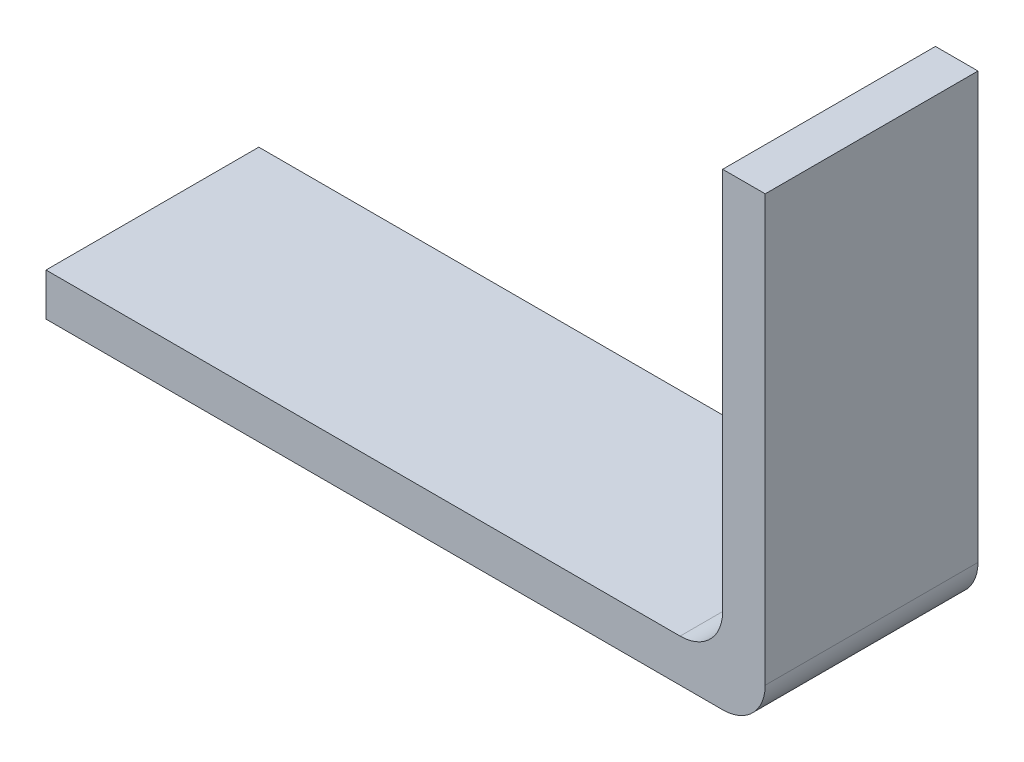
ISO-10303-21;
HEADER;
FILE_DESCRIPTION(('STEP AP214'),'2;1');
FILE_NAME('part.step','',(''),(''),'','','');
FILE_SCHEMA(('AUTOMOTIVE_DESIGN { 1 0 10303 214 1 1 1 1 }'));
ENDSEC;
DATA;
#1=APPLICATION_CONTEXT('core data for automotive mechanical design processes');
#2=APPLICATION_PROTOCOL_DEFINITION('international standard','automotive_design',2000,#1);
#3=PRODUCT_CONTEXT('',#1,'mechanical');
#4=PRODUCT('Part','Part','',(#3));
#5=PRODUCT_RELATED_PRODUCT_CATEGORY('part','',(#4));
#6=PRODUCT_DEFINITION_FORMATION('','',#4);
#7=PRODUCT_DEFINITION_CONTEXT('part definition',#1,'design');
#8=PRODUCT_DEFINITION('design','',#6,#7);
#9=PRODUCT_DEFINITION_SHAPE('','',#8);
#10=(LENGTH_UNIT() NAMED_UNIT(*) SI_UNIT(.MILLI.,.METRE.));
#11=(NAMED_UNIT(*) PLANE_ANGLE_UNIT() SI_UNIT($,.RADIAN.));
#12=(NAMED_UNIT(*) SI_UNIT($,.STERADIAN.) SOLID_ANGLE_UNIT());
#13=UNCERTAINTY_MEASURE_WITH_UNIT(LENGTH_MEASURE(1.E-05),#10,'distance_accuracy_value','');
#14=(GEOMETRIC_REPRESENTATION_CONTEXT(3) GLOBAL_UNCERTAINTY_ASSIGNED_CONTEXT((#13)) GLOBAL_UNIT_ASSIGNED_CONTEXT((#10,
#11,#12)) REPRESENTATION_CONTEXT('',''));
#15=CARTESIAN_POINT('',(0.,0.,0.));
#16=DIRECTION('',(0.,0.,1.));
#17=DIRECTION('',(1.,0.,0.));
#18=AXIS2_PLACEMENT_3D('',#15,#16,#17);
#19=CARTESIAN_POINT('',(16.9,0.,5.));
#20=DIRECTION('',(-1.,0.,0.));
#21=DIRECTION('',(0.,0.,1.));
#22=AXIS2_PLACEMENT_3D('',#19,#20,#21);
#23=PLANE('',#22);
#24=DIRECTION('',(0.,1.,0.));
#25=VECTOR('',#24,1.);
#26=CARTESIAN_POINT('',(16.9,0.,5.));
#27=LINE('',#26,#25);
#28=CARTESIAN_POINT('',(16.9,0.,5.));
#29=VERTEX_POINT('',#28);
#30=CARTESIAN_POINT('',(16.9,10.,5.));
#31=VERTEX_POINT('',#30);
#32=EDGE_CURVE('E97',#29,#31,#27,.T.);
#33=ORIENTED_EDGE('',*,*,#32,.F.);
#34=DIRECTION('',(0.,0.,-1.));
#35=VECTOR('',#34,1.);
#36=CARTESIAN_POINT('',(16.9,0.,5.));
#37=LINE('',#36,#35);
#38=CARTESIAN_POINT('',(16.9,0.,0.));
#39=VERTEX_POINT('',#38);
#40=EDGE_CURVE('E117',#29,#39,#37,.T.);
#41=ORIENTED_EDGE('',*,*,#40,.T.);
#42=DIRECTION('',(0.,1.,0.));
#43=VECTOR('',#42,1.);
#44=CARTESIAN_POINT('',(16.9,0.,0.));
#45=LINE('',#44,#43);
#46=CARTESIAN_POINT('',(16.9,10.,0.));
#47=VERTEX_POINT('',#46);
#48=EDGE_CURVE('E113',#39,#47,#45,.T.);
#49=ORIENTED_EDGE('',*,*,#48,.T.);
#50=DIRECTION('',(0.,0.,-1.));
#51=VECTOR('',#50,1.);
#52=CARTESIAN_POINT('',(16.9,10.,5.));
#53=LINE('',#52,#51);
#54=EDGE_CURVE('E111',#31,#47,#53,.T.);
#55=ORIENTED_EDGE('',*,*,#54,.F.);
#56=EDGE_LOOP('',(#33,#41,#49,#55));
#57=FACE_BOUND('',#56,.T.);
#58=ADVANCED_FACE('F33',(#57),#23,.F.);
#59=CARTESIAN_POINT('',(15.9,10.,5.));
#60=DIRECTION('',(0.,1.,0.));
#61=DIRECTION('',(0.,0.,1.));
#62=AXIS2_PLACEMENT_3D('',#59,#60,#61);
#63=PLANE('',#62);
#64=DIRECTION('',(1.,0.,0.));
#65=VECTOR('',#64,1.);
#66=CARTESIAN_POINT('',(15.9,10.,0.));
#67=LINE('',#66,#65);
#68=CARTESIAN_POINT('',(15.9,10.,0.));
#69=VERTEX_POINT('',#68);
#70=EDGE_CURVE('E136',#69,#47,#67,.T.);
#71=ORIENTED_EDGE('',*,*,#70,.F.);
#72=DIRECTION('',(0.,0.,-1.));
#73=VECTOR('',#72,1.);
#74=CARTESIAN_POINT('',(15.9,10.,5.));
#75=LINE('',#74,#73);
#76=CARTESIAN_POINT('',(15.9,10.,5.));
#77=VERTEX_POINT('',#76);
#78=EDGE_CURVE('E118',#77,#69,#75,.T.);
#79=ORIENTED_EDGE('',*,*,#78,.F.);
#80=DIRECTION('',(1.,0.,0.));
#81=VECTOR('',#80,1.);
#82=CARTESIAN_POINT('',(15.9,10.,5.));
#83=LINE('',#82,#81);
#84=EDGE_CURVE('E102',#77,#31,#83,.T.);
#85=ORIENTED_EDGE('',*,*,#84,.T.);
#86=ORIENTED_EDGE('',*,*,#54,.T.);
#87=EDGE_LOOP('',(#71,#79,#85,#86));
#88=FACE_BOUND('',#87,.T.);
#89=ADVANCED_FACE('F121',(#88),#63,.T.);
#90=CARTESIAN_POINT('',(15.9,0.,5.));
#91=DIRECTION('',(-1.,0.,0.));
#92=DIRECTION('',(0.,0.,1.));
#93=AXIS2_PLACEMENT_3D('',#90,#91,#92);
#94=PLANE('',#93);
#95=DIRECTION('',(0.,1.,0.));
#96=VECTOR('',#95,1.);
#97=CARTESIAN_POINT('',(15.9,0.,0.));
#98=LINE('',#97,#96);
#99=CARTESIAN_POINT('',(15.9,1.,0.));
#100=VERTEX_POINT('',#99);
#101=EDGE_CURVE('E138',#100,#69,#98,.T.);
#102=ORIENTED_EDGE('',*,*,#101,.F.);
#103=DIRECTION('',(0.,0.,-1.));
#104=VECTOR('',#103,1.);
#105=CARTESIAN_POINT('',(15.9,1.,5.));
#106=LINE('',#105,#104);
#107=CARTESIAN_POINT('',(15.9,1.,5.));
#108=VERTEX_POINT('',#107);
#109=EDGE_CURVE('E54',#100,#108,#106,.F.);
#110=ORIENTED_EDGE('',*,*,#109,.T.);
#111=DIRECTION('',(0.,1.,0.));
#112=VECTOR('',#111,1.);
#113=CARTESIAN_POINT('',(15.9,0.,5.));
#114=LINE('',#113,#112);
#115=EDGE_CURVE('E123',#108,#77,#114,.T.);
#116=ORIENTED_EDGE('',*,*,#115,.T.);
#117=ORIENTED_EDGE('',*,*,#78,.T.);
#118=EDGE_LOOP('',(#102,#110,#116,#117));
#119=FACE_BOUND('',#118,.T.);
#120=ADVANCED_FACE('F166',(#119),#94,.T.);
#121=CARTESIAN_POINT('',(0.,0.,5.));
#122=DIRECTION('',(0.,1.,0.));
#123=DIRECTION('',(0.,0.,1.));
#124=AXIS2_PLACEMENT_3D('',#121,#122,#123);
#125=PLANE('',#124);
#126=DIRECTION('',(1.,0.,0.));
#127=VECTOR('',#126,1.);
#128=CARTESIAN_POINT('',(0.,0.,5.));
#129=LINE('',#128,#127);
#130=CARTESIAN_POINT('',(0.,0.,5.));
#131=VERTEX_POINT('',#130);
#132=CARTESIAN_POINT('',(14.9,0.,5.));
#133=VERTEX_POINT('',#132);
#134=EDGE_CURVE('E125',#131,#133,#129,.T.);
#135=ORIENTED_EDGE('',*,*,#134,.T.);
#136=DIRECTION('',(0.,0.,-1.));
#137=VECTOR('',#136,1.);
#138=CARTESIAN_POINT('',(14.9,0.,0.));
#139=LINE('',#138,#137);
#140=CARTESIAN_POINT('',(14.9,0.,0.));
#141=VERTEX_POINT('',#140);
#142=EDGE_CURVE('E158',#133,#141,#139,.T.);
#143=ORIENTED_EDGE('',*,*,#142,.T.);
#144=DIRECTION('',(1.,0.,0.));
#145=VECTOR('',#144,1.);
#146=CARTESIAN_POINT('',(0.,0.,0.));
#147=LINE('',#146,#145);
#148=CARTESIAN_POINT('',(0.,0.,0.));
#149=VERTEX_POINT('',#148);
#150=EDGE_CURVE('E140',#149,#141,#147,.T.);
#151=ORIENTED_EDGE('',*,*,#150,.F.);
#152=DIRECTION('',(0.,0.,-1.));
#153=VECTOR('',#152,1.);
#154=CARTESIAN_POINT('',(0.,0.,5.));
#155=LINE('',#154,#153);
#156=EDGE_CURVE('E149',#131,#149,#155,.T.);
#157=ORIENTED_EDGE('',*,*,#156,.F.);
#158=EDGE_LOOP('',(#135,#143,#151,#157));
#159=FACE_BOUND('',#158,.T.);
#160=ADVANCED_FACE('F168',(#159),#125,.T.);
#161=CARTESIAN_POINT('',(0.,-1.,5.));
#162=DIRECTION('',(-1.,0.,0.));
#163=DIRECTION('',(0.,0.,1.));
#164=AXIS2_PLACEMENT_3D('',#161,#162,#163);
#165=PLANE('',#164);
#166=DIRECTION('',(0.,1.,0.));
#167=VECTOR('',#166,1.);
#168=CARTESIAN_POINT('',(0.,-1.,0.));
#169=LINE('',#168,#167);
#170=CARTESIAN_POINT('',(0.,-1.,0.));
#171=VERTEX_POINT('',#170);
#172=EDGE_CURVE('E143',#171,#149,#169,.T.);
#173=ORIENTED_EDGE('',*,*,#172,.F.);
#174=DIRECTION('',(0.,0.,-1.));
#175=VECTOR('',#174,1.);
#176=CARTESIAN_POINT('',(0.,-1.,5.));
#177=LINE('',#176,#175);
#178=CARTESIAN_POINT('',(0.,-1.,5.));
#179=VERTEX_POINT('',#178);
#180=EDGE_CURVE('E134',#179,#171,#177,.T.);
#181=ORIENTED_EDGE('',*,*,#180,.F.);
#182=DIRECTION('',(0.,1.,0.));
#183=VECTOR('',#182,1.);
#184=CARTESIAN_POINT('',(0.,-1.,5.));
#185=LINE('',#184,#183);
#186=EDGE_CURVE('E129',#179,#131,#185,.T.);
#187=ORIENTED_EDGE('',*,*,#186,.T.);
#188=ORIENTED_EDGE('',*,*,#156,.T.);
#189=EDGE_LOOP('',(#173,#181,#187,#188));
#190=FACE_BOUND('',#189,.T.);
#191=ADVANCED_FACE('F172',(#190),#165,.T.);
#192=CARTESIAN_POINT('',(0.,-1.,5.));
#193=DIRECTION('',(0.,1.,0.));
#194=DIRECTION('',(0.,0.,1.));
#195=AXIS2_PLACEMENT_3D('',#192,#193,#194);
#196=PLANE('',#195);
#197=DIRECTION('',(1.,0.,0.));
#198=VECTOR('',#197,1.);
#199=CARTESIAN_POINT('',(0.,-1.,0.));
#200=LINE('',#199,#198);
#201=CARTESIAN_POINT('',(15.9,-1.,0.));
#202=VERTEX_POINT('',#201);
#203=EDGE_CURVE('E108',#171,#202,#200,.T.);
#204=ORIENTED_EDGE('',*,*,#203,.T.);
#205=DIRECTION('',(0.,0.,-1.));
#206=VECTOR('',#205,1.);
#207=CARTESIAN_POINT('',(15.9,-1.,5.));
#208=LINE('',#207,#206);
#209=CARTESIAN_POINT('',(15.9,-1.,5.));
#210=VERTEX_POINT('',#209);
#211=EDGE_CURVE('E155',#202,#210,#208,.F.);
#212=ORIENTED_EDGE('',*,*,#211,.T.);
#213=DIRECTION('',(1.,0.,0.));
#214=VECTOR('',#213,1.);
#215=CARTESIAN_POINT('',(0.,-1.,5.));
#216=LINE('',#215,#214);
#217=EDGE_CURVE('E132',#179,#210,#216,.T.);
#218=ORIENTED_EDGE('',*,*,#217,.F.);
#219=ORIENTED_EDGE('',*,*,#180,.T.);
#220=EDGE_LOOP('',(#204,#212,#218,#219));
#221=FACE_BOUND('',#220,.T.);
#222=ADVANCED_FACE('F176',(#221),#196,.F.);
#223=CARTESIAN_POINT('',(0.,0.,5.));
#224=DIRECTION('',(0.,0.,-1.));
#225=DIRECTION('',(-1.,0.,0.));
#226=AXIS2_PLACEMENT_3D('',#223,#224,#225);
#227=PLANE('',#226);
#228=ORIENTED_EDGE('',*,*,#217,.T.);
#229=CARTESIAN_POINT('',(15.9,0.,5.));
#230=DIRECTION('',(0.,0.,-1.));
#231=DIRECTION('',(-1.,0.,0.));
#232=AXIS2_PLACEMENT_3D('',#229,#230,#231);
#233=CIRCLE('',#232,1.);
#234=EDGE_CURVE('E104',#210,#29,#233,.F.);
#235=ORIENTED_EDGE('',*,*,#234,.T.);
#236=ORIENTED_EDGE('',*,*,#32,.T.);
#237=ORIENTED_EDGE('',*,*,#84,.F.);
#238=ORIENTED_EDGE('',*,*,#115,.F.);
#239=CARTESIAN_POINT('',(14.9,1.,5.));
#240=DIRECTION('',(0.,0.,-1.));
#241=DIRECTION('',(-1.,0.,0.));
#242=AXIS2_PLACEMENT_3D('',#239,#240,#241);
#243=CIRCLE('',#242,1.);
#244=EDGE_CURVE('E11',#108,#133,#243,.T.);
#245=ORIENTED_EDGE('',*,*,#244,.T.);
#246=ORIENTED_EDGE('',*,*,#134,.F.);
#247=ORIENTED_EDGE('',*,*,#186,.F.);
#248=EDGE_LOOP('',(#228,#235,#236,#237,#238,#245,#246,#247));
#249=FACE_BOUND('',#248,.T.);
#250=ADVANCED_FACE('F100',(#249),#227,.F.);
#251=CARTESIAN_POINT('',(0.,0.,0.));
#252=DIRECTION('',(0.,0.,-1.));
#253=DIRECTION('',(-1.,0.,0.));
#254=AXIS2_PLACEMENT_3D('',#251,#252,#253);
#255=PLANE('',#254);
#256=ORIENTED_EDGE('',*,*,#48,.F.);
#257=CARTESIAN_POINT('',(15.9,0.,0.));
#258=DIRECTION('',(0.,0.,-1.));
#259=DIRECTION('',(-1.,0.,0.));
#260=AXIS2_PLACEMENT_3D('',#257,#258,#259);
#261=CIRCLE('',#260,1.);
#262=EDGE_CURVE('E153',#39,#202,#261,.T.);
#263=ORIENTED_EDGE('',*,*,#262,.T.);
#264=ORIENTED_EDGE('',*,*,#203,.F.);
#265=ORIENTED_EDGE('',*,*,#172,.T.);
#266=ORIENTED_EDGE('',*,*,#150,.T.);
#267=CARTESIAN_POINT('',(14.9,1.,0.));
#268=DIRECTION('',(0.,0.,-1.));
#269=DIRECTION('',(-1.,0.,0.));
#270=AXIS2_PLACEMENT_3D('',#267,#268,#269);
#271=CIRCLE('',#270,1.);
#272=EDGE_CURVE('E41',#141,#100,#271,.F.);
#273=ORIENTED_EDGE('',*,*,#272,.T.);
#274=ORIENTED_EDGE('',*,*,#101,.T.);
#275=ORIENTED_EDGE('',*,*,#70,.T.);
#276=EDGE_LOOP('',(#256,#263,#264,#265,#266,#273,#274,#275));
#277=FACE_BOUND('',#276,.T.);
#278=ADVANCED_FACE('F162',(#277),#255,.T.);
#279=CARTESIAN_POINT('',(15.9,0.,5.));
#280=DIRECTION('',(0.,0.,-1.));
#281=DIRECTION('',(-1.,0.,0.));
#282=AXIS2_PLACEMENT_3D('',#279,#280,#281);
#283=CYLINDRICAL_SURFACE('',#282,1.);
#284=ORIENTED_EDGE('',*,*,#234,.F.);
#285=ORIENTED_EDGE('',*,*,#211,.F.);
#286=ORIENTED_EDGE('',*,*,#262,.F.);
#287=ORIENTED_EDGE('',*,*,#40,.F.);
#288=EDGE_LOOP('',(#284,#285,#286,#287));
#289=FACE_BOUND('',#288,.T.);
#290=ADVANCED_FACE('F179',(#289),#283,.T.);
#291=CARTESIAN_POINT('',(14.9,1.,5.));
#292=DIRECTION('',(0.,0.,1.));
#293=DIRECTION('',(1.,0.,0.));
#294=AXIS2_PLACEMENT_3D('',#291,#292,#293);
#295=CYLINDRICAL_SURFACE('',#294,1.);
#296=ORIENTED_EDGE('',*,*,#244,.F.);
#297=ORIENTED_EDGE('',*,*,#109,.F.);
#298=ORIENTED_EDGE('',*,*,#272,.F.);
#299=ORIENTED_EDGE('',*,*,#142,.F.);
#300=EDGE_LOOP('',(#296,#297,#298,#299));
#301=FACE_BOUND('',#300,.T.);
#302=ADVANCED_FACE('F35',(#301),#295,.F.);
#303=CLOSED_SHELL('',(#58,#89,#120,#160,#191,#222,#250,#278,#290,#302));
#304=MANIFOLD_SOLID_BREP('B2',#303);
#305=ADVANCED_BREP_SHAPE_REPRESENTATION('',(#18,#304),#14);
#306=SHAPE_DEFINITION_REPRESENTATION(#9,#305);
ENDSEC;
END-ISO-10303-21;
